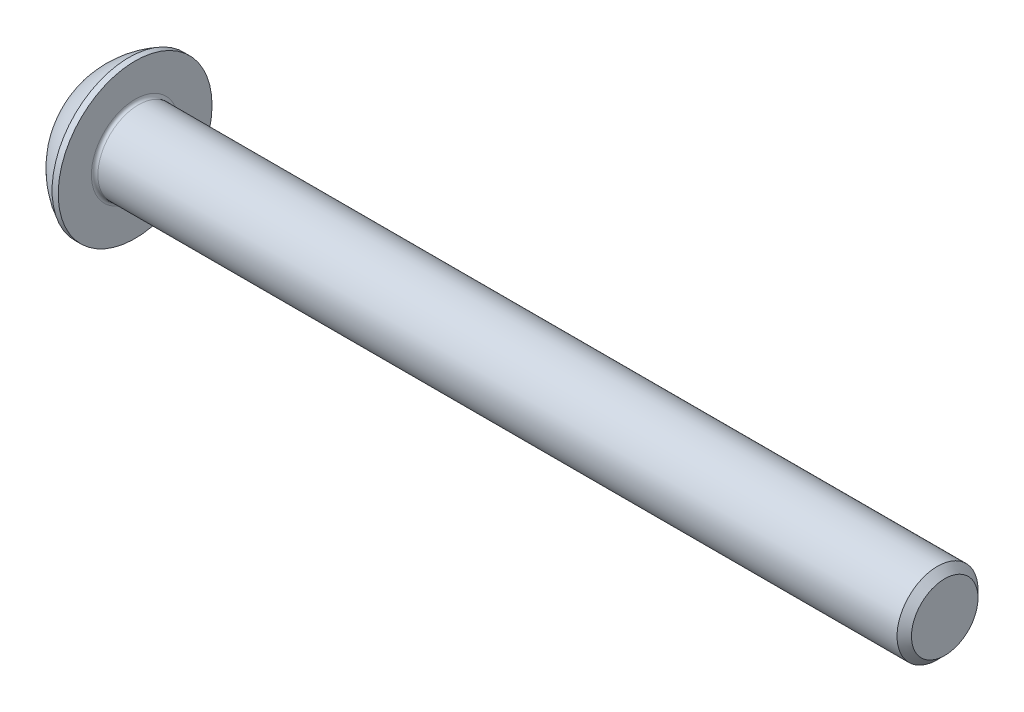
ISO-10303-21;
HEADER;
FILE_DESCRIPTION(('STEP AP214'),'2;1');
FILE_NAME('part.step','',(''),(''),'','','');
FILE_SCHEMA(('AUTOMOTIVE_DESIGN { 1 0 10303 214 1 1 1 1 }'));
ENDSEC;
DATA;
#1=APPLICATION_CONTEXT('core data for automotive mechanical design processes');
#2=APPLICATION_PROTOCOL_DEFINITION('international standard','automotive_design',2000,#1);
#3=PRODUCT_CONTEXT('',#1,'mechanical');
#4=PRODUCT('Part','Part','',(#3));
#5=PRODUCT_RELATED_PRODUCT_CATEGORY('part','',(#4));
#6=PRODUCT_DEFINITION_FORMATION('','',#4);
#7=PRODUCT_DEFINITION_CONTEXT('part definition',#1,'design');
#8=PRODUCT_DEFINITION('design','',#6,#7);
#9=PRODUCT_DEFINITION_SHAPE('','',#8);
#10=(LENGTH_UNIT() NAMED_UNIT(*) SI_UNIT(.MILLI.,.METRE.));
#11=(NAMED_UNIT(*) PLANE_ANGLE_UNIT() SI_UNIT($,.RADIAN.));
#12=(NAMED_UNIT(*) SI_UNIT($,.STERADIAN.) SOLID_ANGLE_UNIT());
#13=UNCERTAINTY_MEASURE_WITH_UNIT(LENGTH_MEASURE(1.E-05),#10,'distance_accuracy_value','');
#14=(GEOMETRIC_REPRESENTATION_CONTEXT(3) GLOBAL_UNCERTAINTY_ASSIGNED_CONTEXT((#13)) GLOBAL_UNIT_ASSIGNED_CONTEXT((#10,
#11,#12)) REPRESENTATION_CONTEXT('',''));
#15=CARTESIAN_POINT('',(0.,0.,0.));
#16=DIRECTION('',(0.,0.,1.));
#17=DIRECTION('',(1.,0.,0.));
#18=AXIS2_PLACEMENT_3D('',#15,#16,#17);
#19=CARTESIAN_POINT('',(4.75485015536768,0.,0.));
#20=DIRECTION('',(1.,0.,0.));
#21=DIRECTION('',(0.,1.,0.));
#22=AXIS2_PLACEMENT_3D('',#19,#20,#21);
#23=SPHERICAL_SURFACE('',#22,5.315);
#24=CARTESIAN_POINT('',(0.,0.,0.));
#25=DIRECTION('',(1.,0.,0.));
#26=DIRECTION('',(0.,0.,-1.));
#27=AXIS2_PLACEMENT_3D('',#24,#25,#26);
#28=CIRCLE('',#27,2.375);
#29=CARTESIAN_POINT('',(0.,0.,-2.375));
#30=VERTEX_POINT('',#29);
#31=EDGE_CURVE('E190',#30,#30,#28,.T.);
#32=ORIENTED_EDGE('',*,*,#31,.T.);
#33=EDGE_LOOP('',(#32));
#34=FACE_BOUND('',#33,.T.);
#35=CARTESIAN_POINT('',(2.37016464151056,0.,0.));
#36=DIRECTION('',(1.,0.,0.));
#37=DIRECTION('',(0.,0.,-1.));
#38=AXIS2_PLACEMENT_3D('',#35,#36,#37);
#39=CIRCLE('',#38,4.75);
#40=CARTESIAN_POINT('',(2.37016464151056,0.,-4.75));
#41=VERTEX_POINT('',#40);
#42=EDGE_CURVE('E177',#41,#41,#39,.T.);
#43=ORIENTED_EDGE('',*,*,#42,.F.);
#44=EDGE_LOOP('',(#43));
#45=FACE_BOUND('',#44,.T.);
#46=ADVANCED_FACE('F34',(#34,#45),#23,.T.);
#47=CARTESIAN_POINT('',(0.,2.375,0.));
#48=DIRECTION('',(-1.,0.,0.));
#49=DIRECTION('',(0.,0.,1.));
#50=AXIS2_PLACEMENT_3D('',#47,#48,#49);
#51=PLANE('',#50);
#52=DIRECTION('',(0.,0.5,-0.866025403784439));
#53=VECTOR('',#52,1.);
#54=CARTESIAN_POINT('',(0.,0.866025403784439,1.5));
#55=LINE('',#54,#53);
#56=CARTESIAN_POINT('',(0.,0.866025403784439,1.5));
#57=VERTEX_POINT('',#56);
#58=CARTESIAN_POINT('',(0.,1.73205080756888,0.));
#59=VERTEX_POINT('',#58);
#60=EDGE_CURVE('E156',#57,#59,#55,.T.);
#61=ORIENTED_EDGE('',*,*,#60,.F.);
#62=DIRECTION('',(0.,1.,0.));
#63=VECTOR('',#62,1.);
#64=CARTESIAN_POINT('',(0.,-0.866025403784438,1.5));
#65=LINE('',#64,#63);
#66=CARTESIAN_POINT('',(0.,-0.866025403784438,1.5));
#67=VERTEX_POINT('',#66);
#68=EDGE_CURVE('E153',#67,#57,#65,.T.);
#69=ORIENTED_EDGE('',*,*,#68,.F.);
#70=DIRECTION('',(0.,0.5,0.866025403784438));
#71=VECTOR('',#70,1.);
#72=CARTESIAN_POINT('',(0.,-1.73205080756888,0.));
#73=LINE('',#72,#71);
#74=CARTESIAN_POINT('',(0.,-1.73205080756888,0.));
#75=VERTEX_POINT('',#74);
#76=EDGE_CURVE('E151',#75,#67,#73,.T.);
#77=ORIENTED_EDGE('',*,*,#76,.F.);
#78=DIRECTION('',(0.,-0.5,0.866025403784438));
#79=VECTOR('',#78,1.);
#80=CARTESIAN_POINT('',(0.,-0.866025403784438,-1.5));
#81=LINE('',#80,#79);
#82=CARTESIAN_POINT('',(0.,-0.866025403784438,-1.5));
#83=VERTEX_POINT('',#82);
#84=EDGE_CURVE('E149',#83,#75,#81,.T.);
#85=ORIENTED_EDGE('',*,*,#84,.F.);
#86=DIRECTION('',(0.,-1.,0.));
#87=VECTOR('',#86,1.);
#88=CARTESIAN_POINT('',(0.,0.866025403784438,-1.5));
#89=LINE('',#88,#87);
#90=CARTESIAN_POINT('',(0.,0.866025403784438,-1.5));
#91=VERTEX_POINT('',#90);
#92=EDGE_CURVE('E123',#91,#83,#89,.T.);
#93=ORIENTED_EDGE('',*,*,#92,.F.);
#94=DIRECTION('',(0.,-0.5,-0.866025403784438));
#95=VECTOR('',#94,1.);
#96=CARTESIAN_POINT('',(0.,1.73205080756888,0.));
#97=LINE('',#96,#95);
#98=EDGE_CURVE('E116',#59,#91,#97,.T.);
#99=ORIENTED_EDGE('',*,*,#98,.F.);
#100=EDGE_LOOP('',(#61,#69,#77,#85,#93,#99));
#101=FACE_BOUND('',#100,.T.);
#102=ORIENTED_EDGE('',*,*,#31,.F.);
#103=EDGE_LOOP('',(#102));
#104=FACE_BOUND('',#103,.T.);
#105=ADVANCED_FACE('F212',(#101,#104),#51,.T.);
#106=CARTESIAN_POINT('',(52.75,0.,0.));
#107=DIRECTION('',(1.,0.,0.));
#108=DIRECTION('',(0.,0.,-1.));
#109=AXIS2_PLACEMENT_3D('',#106,#107,#108);
#110=PLANE('',#109);
#111=CARTESIAN_POINT('',(52.75,0.,0.));
#112=DIRECTION('',(1.,0.,0.));
#113=DIRECTION('',(0.,0.,-1.));
#114=AXIS2_PLACEMENT_3D('',#111,#112,#113);
#115=CIRCLE('',#114,2.05500000000001);
#116=CARTESIAN_POINT('',(52.75,0.,-2.05500000000001));
#117=VERTEX_POINT('',#116);
#118=EDGE_CURVE('E187',#117,#117,#115,.T.);
#119=ORIENTED_EDGE('',*,*,#118,.T.);
#120=EDGE_LOOP('',(#119));
#121=FACE_BOUND('',#120,.T.);
#122=ADVANCED_FACE('F217',(#121),#110,.T.);
#123=CARTESIAN_POINT('',(52.75,0.,0.));
#124=DIRECTION('',(-1.,0.,0.));
#125=DIRECTION('',(0.,0.,1.));
#126=AXIS2_PLACEMENT_3D('',#123,#124,#125);
#127=CONICAL_SURFACE('',#126,2.05500000000001,0.785398163397447);
#128=CARTESIAN_POINT('',(52.305,0.,0.));
#129=DIRECTION('',(1.,0.,0.));
#130=DIRECTION('',(0.,0.,-1.));
#131=AXIS2_PLACEMENT_3D('',#128,#129,#130);
#132=CIRCLE('',#131,2.50000000000001);
#133=CARTESIAN_POINT('',(52.305,0.,-2.50000000000001));
#134=VERTEX_POINT('',#133);
#135=EDGE_CURVE('E184',#134,#134,#132,.T.);
#136=ORIENTED_EDGE('',*,*,#135,.T.);
#137=EDGE_LOOP('',(#136));
#138=FACE_BOUND('',#137,.T.);
#139=ORIENTED_EDGE('',*,*,#118,.F.);
#140=EDGE_LOOP('',(#139));
#141=FACE_BOUND('',#140,.T.);
#142=ADVANCED_FACE('F224',(#138,#141),#127,.T.);
#143=CARTESIAN_POINT('',(-3.64348996551984,0.,0.));
#144=DIRECTION('',(1.,0.,0.));
#145=DIRECTION('',(0.,0.,-1.));
#146=AXIS2_PLACEMENT_3D('',#143,#144,#145);
#147=CYLINDRICAL_SURFACE('',#146,2.5);
#148=CARTESIAN_POINT('',(2.95,0.,0.));
#149=DIRECTION('',(1.,0.,0.));
#150=DIRECTION('',(0.,0.,-1.));
#151=AXIS2_PLACEMENT_3D('',#148,#149,#150);
#152=CIRCLE('',#151,2.5);
#153=CARTESIAN_POINT('',(2.95,0.,-2.5));
#154=VERTEX_POINT('',#153);
#155=EDGE_CURVE('E42',#154,#154,#152,.T.);
#156=ORIENTED_EDGE('',*,*,#155,.T.);
#157=EDGE_LOOP('',(#156));
#158=FACE_BOUND('',#157,.T.);
#159=ORIENTED_EDGE('',*,*,#135,.F.);
#160=EDGE_LOOP('',(#159));
#161=FACE_BOUND('',#160,.T.);
#162=ADVANCED_FACE('F195',(#158,#161),#147,.T.);
#163=CARTESIAN_POINT('',(2.75,2.5,0.));
#164=DIRECTION('',(1.,0.,0.));
#165=DIRECTION('',(0.,0.,-1.));
#166=AXIS2_PLACEMENT_3D('',#163,#164,#165);
#167=PLANE('',#166);
#168=CARTESIAN_POINT('',(2.75,0.,0.));
#169=DIRECTION('',(1.,0.,0.));
#170=DIRECTION('',(0.,0.,-1.));
#171=AXIS2_PLACEMENT_3D('',#168,#169,#170);
#172=CIRCLE('',#171,2.7);
#173=CARTESIAN_POINT('',(2.75,0.,-2.7));
#174=VERTEX_POINT('',#173);
#175=EDGE_CURVE('E11',#174,#174,#172,.F.);
#176=ORIENTED_EDGE('',*,*,#175,.T.);
#177=EDGE_LOOP('',(#176));
#178=FACE_BOUND('',#177,.T.);
#179=CARTESIAN_POINT('',(2.75,0.,0.));
#180=DIRECTION('',(1.,0.,0.));
#181=DIRECTION('',(0.,0.,-1.));
#182=AXIS2_PLACEMENT_3D('',#179,#180,#181);
#183=CIRCLE('',#182,4.75);
#184=CARTESIAN_POINT('',(2.75,0.,-4.75));
#185=VERTEX_POINT('',#184);
#186=EDGE_CURVE('E181',#185,#185,#183,.T.);
#187=ORIENTED_EDGE('',*,*,#186,.T.);
#188=EDGE_LOOP('',(#187));
#189=FACE_BOUND('',#188,.T.);
#190=ADVANCED_FACE('F207',(#178,#189),#167,.T.);
#191=CARTESIAN_POINT('',(-3.64348996551984,0.,0.));
#192=DIRECTION('',(1.,0.,0.));
#193=DIRECTION('',(0.,0.,-1.));
#194=AXIS2_PLACEMENT_3D('',#191,#192,#193);
#195=CYLINDRICAL_SURFACE('',#194,4.75);
#196=ORIENTED_EDGE('',*,*,#42,.T.);
#197=EDGE_LOOP('',(#196));
#198=FACE_BOUND('',#197,.T.);
#199=ORIENTED_EDGE('',*,*,#186,.F.);
#200=EDGE_LOOP('',(#199));
#201=FACE_BOUND('',#200,.T.);
#202=ADVANCED_FACE('F199',(#198,#201),#195,.T.);
#203=CARTESIAN_POINT('',(2.95,0.,0.));
#204=DIRECTION('',(1.,0.,0.));
#205=DIRECTION('',(0.,0.,-1.));
#206=AXIS2_PLACEMENT_3D('',#203,#204,#205);
#207=TOROIDAL_SURFACE('',#206,2.7,0.2);
#208=ORIENTED_EDGE('',*,*,#175,.F.);
#209=EDGE_LOOP('',(#208));
#210=FACE_BOUND('',#209,.T.);
#211=ORIENTED_EDGE('',*,*,#155,.F.);
#212=EDGE_LOOP('',(#211));
#213=FACE_BOUND('',#212,.T.);
#214=ADVANCED_FACE('F36',(#210,#213),#207,.F.);
#215=CARTESIAN_POINT('',(1.56,0.866025403784438,-1.5));
#216=DIRECTION('',(0.,0.,-1.));
#217=DIRECTION('',(-1.,0.,0.));
#218=AXIS2_PLACEMENT_3D('',#215,#216,#217);
#219=PLANE('',#218);
#220=DIRECTION('',(0.,-1.,0.));
#221=VECTOR('',#220,1.);
#222=CARTESIAN_POINT('',(1.56,0.866025403784438,-1.5));
#223=LINE('',#222,#221);
#224=CARTESIAN_POINT('',(1.56,0.866025403784438,-1.5));
#225=VERTEX_POINT('',#224);
#226=CARTESIAN_POINT('',(1.56,0.,-1.5));
#227=VERTEX_POINT('',#226);
#228=EDGE_CURVE('E115',#225,#227,#223,.T.);
#229=ORIENTED_EDGE('',*,*,#228,.F.);
#230=DIRECTION('',(-1.,0.,0.));
#231=VECTOR('',#230,1.);
#232=CARTESIAN_POINT('',(1.56,0.866025403784438,-1.5));
#233=LINE('',#232,#231);
#234=EDGE_CURVE('E161',#225,#91,#233,.T.);
#235=ORIENTED_EDGE('',*,*,#234,.T.);
#236=ORIENTED_EDGE('',*,*,#92,.T.);
#237=DIRECTION('',(-1.,0.,0.));
#238=VECTOR('',#237,1.);
#239=CARTESIAN_POINT('',(1.56,-0.866025403784438,-1.5));
#240=LINE('',#239,#238);
#241=CARTESIAN_POINT('',(1.56,-0.866025403784438,-1.5));
#242=VERTEX_POINT('',#241);
#243=EDGE_CURVE('E120',#242,#83,#240,.T.);
#244=ORIENTED_EDGE('',*,*,#243,.F.);
#245=EDGE_CURVE('E105',#227,#242,#223,.T.);
#246=ORIENTED_EDGE('',*,*,#245,.F.);
#247=EDGE_LOOP('',(#229,#235,#236,#244,#246));
#248=FACE_BOUND('',#247,.T.);
#249=ADVANCED_FACE('F121',(#248),#219,.F.);
#250=CARTESIAN_POINT('',(1.56,1.73205080756888,0.));
#251=DIRECTION('',(0.,0.866025403784438,-0.5));
#252=DIRECTION('',(0.,0.5,0.866025403784439));
#253=AXIS2_PLACEMENT_3D('',#250,#251,#252);
#254=PLANE('',#253);
#255=DIRECTION('',(0.,-0.5,-0.866025403784438));
#256=VECTOR('',#255,1.);
#257=CARTESIAN_POINT('',(1.56,1.73205080756888,0.));
#258=LINE('',#257,#256);
#259=CARTESIAN_POINT('',(1.56,1.73205080756888,0.));
#260=VERTEX_POINT('',#259);
#261=CARTESIAN_POINT('',(1.56,1.29903810567666,-0.75));
#262=VERTEX_POINT('',#261);
#263=EDGE_CURVE('E127',#260,#262,#258,.T.);
#264=ORIENTED_EDGE('',*,*,#263,.F.);
#265=DIRECTION('',(-1.,0.,0.));
#266=VECTOR('',#265,1.);
#267=CARTESIAN_POINT('',(1.56,1.73205080756888,0.));
#268=LINE('',#267,#266);
#269=EDGE_CURVE('E164',#260,#59,#268,.T.);
#270=ORIENTED_EDGE('',*,*,#269,.T.);
#271=ORIENTED_EDGE('',*,*,#98,.T.);
#272=ORIENTED_EDGE('',*,*,#234,.F.);
#273=EDGE_CURVE('E145',#262,#225,#258,.T.);
#274=ORIENTED_EDGE('',*,*,#273,.F.);
#275=EDGE_LOOP('',(#264,#270,#271,#272,#274));
#276=FACE_BOUND('',#275,.T.);
#277=ADVANCED_FACE('F205',(#276),#254,.F.);
#278=CARTESIAN_POINT('',(1.56,0.866025403784439,1.5));
#279=DIRECTION('',(0.,0.866025403784439,0.5));
#280=DIRECTION('',(0.,-0.5,0.866025403784439));
#281=AXIS2_PLACEMENT_3D('',#278,#279,#280);
#282=PLANE('',#281);
#283=DIRECTION('',(0.,0.5,-0.866025403784439));
#284=VECTOR('',#283,1.);
#285=CARTESIAN_POINT('',(1.56,0.866025403784439,1.5));
#286=LINE('',#285,#284);
#287=CARTESIAN_POINT('',(1.56,0.866025403784439,1.5));
#288=VERTEX_POINT('',#287);
#289=CARTESIAN_POINT('',(1.56,1.29903810567666,0.75));
#290=VERTEX_POINT('',#289);
#291=EDGE_CURVE('E49',#288,#290,#286,.T.);
#292=ORIENTED_EDGE('',*,*,#291,.F.);
#293=DIRECTION('',(-1.,0.,0.));
#294=VECTOR('',#293,1.);
#295=CARTESIAN_POINT('',(1.56,0.866025403784439,1.5));
#296=LINE('',#295,#294);
#297=EDGE_CURVE('E167',#288,#57,#296,.T.);
#298=ORIENTED_EDGE('',*,*,#297,.T.);
#299=ORIENTED_EDGE('',*,*,#60,.T.);
#300=ORIENTED_EDGE('',*,*,#269,.F.);
#301=EDGE_CURVE('E143',#290,#260,#286,.T.);
#302=ORIENTED_EDGE('',*,*,#301,.F.);
#303=EDGE_LOOP('',(#292,#298,#299,#300,#302));
#304=FACE_BOUND('',#303,.T.);
#305=ADVANCED_FACE('F249',(#304),#282,.F.);
#306=CARTESIAN_POINT('',(1.56,-0.866025403784438,1.5));
#307=DIRECTION('',(0.,0.,1.));
#308=DIRECTION('',(0.,-1.,0.));
#309=AXIS2_PLACEMENT_3D('',#306,#307,#308);
#310=PLANE('',#309);
#311=DIRECTION('',(0.,1.,0.));
#312=VECTOR('',#311,1.);
#313=CARTESIAN_POINT('',(1.56,-0.866025403784438,1.5));
#314=LINE('',#313,#312);
#315=CARTESIAN_POINT('',(1.56,-0.866025403784438,1.5));
#316=VERTEX_POINT('',#315);
#317=CARTESIAN_POINT('',(1.56,0.,1.5));
#318=VERTEX_POINT('',#317);
#319=EDGE_CURVE('E140',#316,#318,#314,.T.);
#320=ORIENTED_EDGE('',*,*,#319,.F.);
#321=DIRECTION('',(-1.,0.,0.));
#322=VECTOR('',#321,1.);
#323=CARTESIAN_POINT('',(1.56,-0.866025403784438,1.5));
#324=LINE('',#323,#322);
#325=EDGE_CURVE('E170',#316,#67,#324,.T.);
#326=ORIENTED_EDGE('',*,*,#325,.T.);
#327=ORIENTED_EDGE('',*,*,#68,.T.);
#328=ORIENTED_EDGE('',*,*,#297,.F.);
#329=EDGE_CURVE('E139',#318,#288,#314,.T.);
#330=ORIENTED_EDGE('',*,*,#329,.F.);
#331=EDGE_LOOP('',(#320,#326,#327,#328,#330));
#332=FACE_BOUND('',#331,.T.);
#333=ADVANCED_FACE('F245',(#332),#310,.F.);
#334=CARTESIAN_POINT('',(1.56,-1.73205080756888,0.));
#335=DIRECTION('',(0.,-0.866025403784438,0.5));
#336=DIRECTION('',(0.,-0.5,-0.866025403784439));
#337=AXIS2_PLACEMENT_3D('',#334,#335,#336);
#338=PLANE('',#337);
#339=DIRECTION('',(0.,0.5,0.866025403784438));
#340=VECTOR('',#339,1.);
#341=CARTESIAN_POINT('',(1.56,-1.73205080756888,0.));
#342=LINE('',#341,#340);
#343=CARTESIAN_POINT('',(1.56,-1.73205080756888,0.));
#344=VERTEX_POINT('',#343);
#345=CARTESIAN_POINT('',(1.56,-1.29903810567666,0.75));
#346=VERTEX_POINT('',#345);
#347=EDGE_CURVE('E135',#344,#346,#342,.T.);
#348=ORIENTED_EDGE('',*,*,#347,.F.);
#349=DIRECTION('',(-1.,0.,0.));
#350=VECTOR('',#349,1.);
#351=CARTESIAN_POINT('',(1.56,-1.73205080756888,0.));
#352=LINE('',#351,#350);
#353=EDGE_CURVE('E126',#344,#75,#352,.T.);
#354=ORIENTED_EDGE('',*,*,#353,.T.);
#355=ORIENTED_EDGE('',*,*,#76,.T.);
#356=ORIENTED_EDGE('',*,*,#325,.F.);
#357=EDGE_CURVE('E133',#346,#316,#342,.T.);
#358=ORIENTED_EDGE('',*,*,#357,.F.);
#359=EDGE_LOOP('',(#348,#354,#355,#356,#358));
#360=FACE_BOUND('',#359,.T.);
#361=ADVANCED_FACE('F242',(#360),#338,.F.);
#362=CARTESIAN_POINT('',(1.56,-0.866025403784438,-1.5));
#363=DIRECTION('',(0.,-0.866025403784438,-0.5));
#364=DIRECTION('',(0.,0.5,-0.866025403784439));
#365=AXIS2_PLACEMENT_3D('',#362,#363,#364);
#366=PLANE('',#365);
#367=DIRECTION('',(0.,-0.5,0.866025403784438));
#368=VECTOR('',#367,1.);
#369=CARTESIAN_POINT('',(1.56,-0.866025403784438,-1.5));
#370=LINE('',#369,#368);
#371=CARTESIAN_POINT('',(1.56,-1.29903810567666,-0.75));
#372=VERTEX_POINT('',#371);
#373=EDGE_CURVE('E109',#242,#372,#370,.T.);
#374=ORIENTED_EDGE('',*,*,#373,.F.);
#375=ORIENTED_EDGE('',*,*,#243,.T.);
#376=ORIENTED_EDGE('',*,*,#84,.T.);
#377=ORIENTED_EDGE('',*,*,#353,.F.);
#378=EDGE_CURVE('E132',#372,#344,#370,.T.);
#379=ORIENTED_EDGE('',*,*,#378,.F.);
#380=EDGE_LOOP('',(#374,#375,#376,#377,#379));
#381=FACE_BOUND('',#380,.T.);
#382=ADVANCED_FACE('F130',(#381),#366,.F.);
#383=CARTESIAN_POINT('',(1.56,0.,0.));
#384=DIRECTION('',(-1.,0.,0.));
#385=DIRECTION('',(0.,0.,1.));
#386=AXIS2_PLACEMENT_3D('',#383,#384,#385);
#387=PLANE('',#386);
#388=CARTESIAN_POINT('',(1.56,0.,0.));
#389=DIRECTION('',(1.,0.,0.));
#390=DIRECTION('',(0.,1.,0.));
#391=AXIS2_PLACEMENT_3D('',#388,#389,#390);
#392=CIRCLE('',#391,1.5);
#393=EDGE_CURVE('E178',#318,#346,#392,.T.);
#394=ORIENTED_EDGE('',*,*,#393,.T.);
#395=ORIENTED_EDGE('',*,*,#357,.T.);
#396=ORIENTED_EDGE('',*,*,#319,.T.);
#397=EDGE_LOOP('',(#394,#395,#396));
#398=FACE_BOUND('',#397,.T.);
#399=ADVANCED_FACE('F241',(#398),#387,.T.);
#400=EDGE_CURVE('E280',#346,#372,#392,.T.);
#401=ORIENTED_EDGE('',*,*,#400,.T.);
#402=ORIENTED_EDGE('',*,*,#378,.T.);
#403=ORIENTED_EDGE('',*,*,#347,.T.);
#404=EDGE_LOOP('',(#401,#402,#403));
#405=FACE_BOUND('',#404,.T.);
#406=ADVANCED_FACE('F258',(#405),#387,.T.);
#407=EDGE_CURVE('E111',#372,#227,#392,.T.);
#408=ORIENTED_EDGE('',*,*,#407,.T.);
#409=ORIENTED_EDGE('',*,*,#245,.T.);
#410=ORIENTED_EDGE('',*,*,#373,.T.);
#411=EDGE_LOOP('',(#408,#409,#410));
#412=FACE_BOUND('',#411,.T.);
#413=ADVANCED_FACE('F107',(#412),#387,.T.);
#414=EDGE_CURVE('E281',#227,#262,#392,.T.);
#415=ORIENTED_EDGE('',*,*,#414,.T.);
#416=ORIENTED_EDGE('',*,*,#273,.T.);
#417=ORIENTED_EDGE('',*,*,#228,.T.);
#418=EDGE_LOOP('',(#415,#416,#417));
#419=FACE_BOUND('',#418,.T.);
#420=ADVANCED_FACE('F269',(#419),#387,.T.);
#421=EDGE_CURVE('E163',#262,#290,#392,.T.);
#422=ORIENTED_EDGE('',*,*,#421,.T.);
#423=ORIENTED_EDGE('',*,*,#301,.T.);
#424=ORIENTED_EDGE('',*,*,#263,.T.);
#425=EDGE_LOOP('',(#422,#423,#424));
#426=FACE_BOUND('',#425,.T.);
#427=ADVANCED_FACE('F265',(#426),#387,.T.);
#428=EDGE_CURVE('E175',#290,#318,#392,.T.);
#429=ORIENTED_EDGE('',*,*,#428,.T.);
#430=ORIENTED_EDGE('',*,*,#329,.T.);
#431=ORIENTED_EDGE('',*,*,#291,.T.);
#432=EDGE_LOOP('',(#429,#430,#431));
#433=FACE_BOUND('',#432,.T.);
#434=ADVANCED_FACE('F236',(#433),#387,.T.);
#435=CARTESIAN_POINT('',(2.42602540378445,0.,0.));
#436=DIRECTION('',(-1.,0.,0.));
#437=DIRECTION('',(0.,-1.,0.));
#438=AXIS2_PLACEMENT_3D('',#435,#436,#437);
#439=CONICAL_SURFACE('',#438,0.,1.04719755119659);
#440=ORIENTED_EDGE('',*,*,#428,.F.);
#441=ORIENTED_EDGE('',*,*,#421,.F.);
#442=ORIENTED_EDGE('',*,*,#414,.F.);
#443=ORIENTED_EDGE('',*,*,#407,.F.);
#444=ORIENTED_EDGE('',*,*,#400,.F.);
#445=ORIENTED_EDGE('',*,*,#393,.F.);
#446=EDGE_LOOP('',(#440,#441,#442,#443,#444,#445));
#447=FACE_BOUND('',#446,.T.);
#448=CARTESIAN_POINT('',(2.42602540378445,0.,0.));
#449=VERTEX_POINT('',#448);
#450=VERTEX_LOOP('',#449);
#451=FACE_BOUND('',#450,.T.);
#452=ADVANCED_FACE('F234',(#447,#451),#439,.F.);
#453=CLOSED_SHELL('',(#46,#105,#122,#142,#162,#190,#202,#214,#249,#277,#305,#333,#361,#382,#399,
#406,#413,#420,#427,#434,#452));
#454=MANIFOLD_SOLID_BREP('B2',#453);
#455=ADVANCED_BREP_SHAPE_REPRESENTATION('',(#18,#454),#14);
#456=SHAPE_DEFINITION_REPRESENTATION(#9,#455);
ENDSEC;
END-ISO-10303-21;
